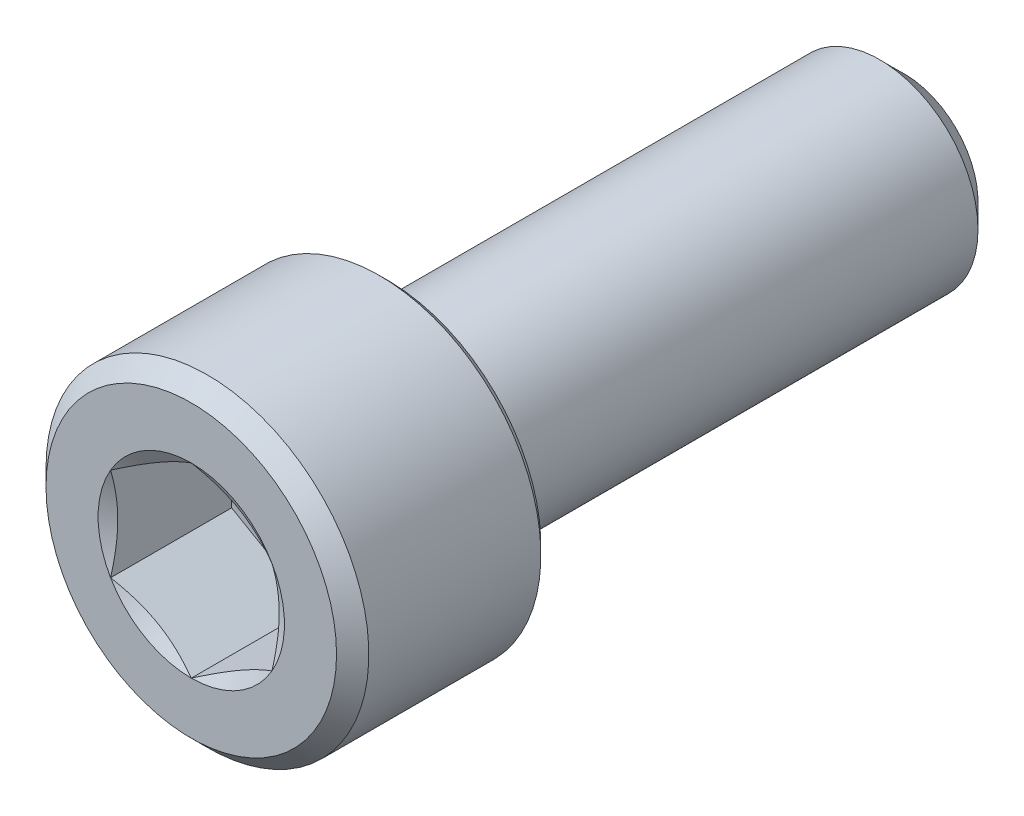
ISO-10303-21;
HEADER;
FILE_DESCRIPTION(('STEP AP214'),'2;1');
FILE_NAME('part.step','',(''),(''),'','','');
FILE_SCHEMA(('AUTOMOTIVE_DESIGN { 1 0 10303 214 1 1 1 1 }'));
ENDSEC;
DATA;
#1=APPLICATION_CONTEXT('core data for automotive mechanical design processes');
#2=APPLICATION_PROTOCOL_DEFINITION('international standard','automotive_design',2000,#1);
#3=PRODUCT_CONTEXT('',#1,'mechanical');
#4=PRODUCT('Part','Part','',(#3));
#5=PRODUCT_RELATED_PRODUCT_CATEGORY('part','',(#4));
#6=PRODUCT_DEFINITION_FORMATION('','',#4);
#7=PRODUCT_DEFINITION_CONTEXT('part definition',#1,'design');
#8=PRODUCT_DEFINITION('design','',#6,#7);
#9=PRODUCT_DEFINITION_SHAPE('','',#8);
#10=(LENGTH_UNIT() NAMED_UNIT(*) SI_UNIT(.MILLI.,.METRE.));
#11=(NAMED_UNIT(*) PLANE_ANGLE_UNIT() SI_UNIT($,.RADIAN.));
#12=(NAMED_UNIT(*) SI_UNIT($,.STERADIAN.) SOLID_ANGLE_UNIT());
#13=UNCERTAINTY_MEASURE_WITH_UNIT(LENGTH_MEASURE(1.E-05),#10,'distance_accuracy_value','');
#14=(GEOMETRIC_REPRESENTATION_CONTEXT(3) GLOBAL_UNCERTAINTY_ASSIGNED_CONTEXT((#13)) GLOBAL_UNIT_ASSIGNED_CONTEXT((#10,
#11,#12)) REPRESENTATION_CONTEXT('',''));
#15=CARTESIAN_POINT('',(0.,0.,0.));
#16=DIRECTION('',(0.,0.,1.));
#17=DIRECTION('',(1.,0.,0.));
#18=AXIS2_PLACEMENT_3D('',#15,#16,#17);
#19=CARTESIAN_POINT('',(0.,3.96875,8.763));
#20=DIRECTION('',(0.,0.,1.));
#21=DIRECTION('',(1.,0.,0.));
#22=AXIS2_PLACEMENT_3D('',#19,#20,#21);
#23=PLANE('',#22);
#24=CARTESIAN_POINT('',(0.,0.,8.763));
#25=DIRECTION('',(0.,0.,1.));
#26=DIRECTION('',(1.,0.,0.));
#27=AXIS2_PLACEMENT_3D('',#24,#25,#26);
#28=CIRCLE('',#27,3.571875);
#29=CARTESIAN_POINT('',(-3.571875,0.,8.763));
#30=VERTEX_POINT('',#29);
#31=EDGE_CURVE('E169',#30,#30,#28,.T.);
#32=ORIENTED_EDGE('',*,*,#31,.T.);
#33=EDGE_LOOP('',(#32));
#34=FACE_BOUND('',#33,.T.);
#35=CARTESIAN_POINT('',(0.,0.,8.763));
#36=DIRECTION('',(0.,0.,1.));
#37=DIRECTION('',(1.,0.,0.));
#38=AXIS2_PLACEMENT_3D('',#35,#36,#37);
#39=CIRCLE('',#38,2.29135888084633);
#40=CARTESIAN_POINT('',(1.984375,1.14567944042316,8.763));
#41=VERTEX_POINT('',#40);
#42=CARTESIAN_POINT('',(0.,2.29135888084632,8.763));
#43=VERTEX_POINT('',#42);
#44=EDGE_CURVE('E87',#41,#43,#39,.T.);
#45=ORIENTED_EDGE('',*,*,#44,.F.);
#46=CARTESIAN_POINT('',(1.984375,-1.14567944042316,8.763));
#47=VERTEX_POINT('',#46);
#48=EDGE_CURVE('E47',#47,#41,#39,.T.);
#49=ORIENTED_EDGE('',*,*,#48,.F.);
#50=CARTESIAN_POINT('',(0.,-2.29135888084633,8.763));
#51=VERTEX_POINT('',#50);
#52=EDGE_CURVE('E274',#51,#47,#39,.T.);
#53=ORIENTED_EDGE('',*,*,#52,.F.);
#54=CARTESIAN_POINT('',(-1.984375,-1.14567944042317,8.763));
#55=VERTEX_POINT('',#54);
#56=EDGE_CURVE('E54',#55,#51,#39,.T.);
#57=ORIENTED_EDGE('',*,*,#56,.F.);
#58=CARTESIAN_POINT('',(-1.984375,1.14567944042316,8.763));
#59=VERTEX_POINT('',#58);
#60=EDGE_CURVE('E127',#59,#55,#39,.T.);
#61=ORIENTED_EDGE('',*,*,#60,.F.);
#62=EDGE_CURVE('E96',#43,#59,#39,.T.);
#63=ORIENTED_EDGE('',*,*,#62,.F.);
#64=EDGE_LOOP('',(#45,#49,#53,#57,#61,#63));
#65=FACE_BOUND('',#64,.T.);
#66=ADVANCED_FACE('F33',(#34,#65),#23,.T.);
#67=CARTESIAN_POINT('',(0.,0.,-8.763));
#68=DIRECTION('',(0.,0.,-1.));
#69=DIRECTION('',(-1.,0.,0.));
#70=AXIS2_PLACEMENT_3D('',#67,#68,#69);
#71=CYLINDRICAL_SURFACE('',#70,3.96875);
#72=CARTESIAN_POINT('',(0.,0.,4.13543749999999));
#73=DIRECTION('',(0.,0.,-1.));
#74=DIRECTION('',(-1.,0.,0.));
#75=AXIS2_PLACEMENT_3D('',#72,#73,#74);
#76=CIRCLE('',#75,3.96875);
#77=CARTESIAN_POINT('',(-3.96875,0.,4.13543749999999));
#78=VERTEX_POINT('',#77);
#79=EDGE_CURVE('E11',#78,#78,#76,.F.);
#80=ORIENTED_EDGE('',*,*,#79,.T.);
#81=EDGE_LOOP('',(#80));
#82=FACE_BOUND('',#81,.T.);
#83=CARTESIAN_POINT('',(0.,0.,8.366125));
#84=DIRECTION('',(0.,0.,1.));
#85=DIRECTION('',(1.,0.,0.));
#86=AXIS2_PLACEMENT_3D('',#83,#84,#85);
#87=CIRCLE('',#86,3.96875);
#88=CARTESIAN_POINT('',(-3.96875,0.,8.366125));
#89=VERTEX_POINT('',#88);
#90=EDGE_CURVE('E106',#89,#89,#87,.F.);
#91=ORIENTED_EDGE('',*,*,#90,.T.);
#92=EDGE_LOOP('',(#91));
#93=FACE_BOUND('',#92,.T.);
#94=ADVANCED_FACE('F186',(#82,#93),#71,.T.);
#95=CARTESIAN_POINT('',(0.,3.96875,3.937));
#96=DIRECTION('',(0.,0.,-1.));
#97=DIRECTION('',(-1.,0.,0.));
#98=AXIS2_PLACEMENT_3D('',#95,#96,#97);
#99=PLANE('',#98);
#100=CARTESIAN_POINT('',(0.,0.,3.937));
#101=DIRECTION('',(0.,0.,-1.));
#102=DIRECTION('',(-1.,0.,0.));
#103=AXIS2_PLACEMENT_3D('',#100,#101,#102);
#104=CIRCLE('',#103,3.77031250000001);
#105=CARTESIAN_POINT('',(-3.77031250000001,0.,3.937));
#106=VERTEX_POINT('',#105);
#107=EDGE_CURVE('E41',#106,#106,#104,.T.);
#108=ORIENTED_EDGE('',*,*,#107,.T.);
#109=EDGE_LOOP('',(#108));
#110=FACE_BOUND('',#109,.T.);
#111=CARTESIAN_POINT('',(0.,0.,3.937));
#112=DIRECTION('',(0.,0.,-1.));
#113=DIRECTION('',(-1.,0.,0.));
#114=AXIS2_PLACEMENT_3D('',#111,#112,#113);
#115=CIRCLE('',#114,2.413);
#116=CARTESIAN_POINT('',(-2.413,0.,3.937));
#117=VERTEX_POINT('',#116);
#118=EDGE_CURVE('E107',#117,#117,#115,.T.);
#119=ORIENTED_EDGE('',*,*,#118,.F.);
#120=EDGE_LOOP('',(#119));
#121=FACE_BOUND('',#120,.T.);
#122=ADVANCED_FACE('F174',(#110,#121),#99,.T.);
#123=CARTESIAN_POINT('',(0.,0.,-8.763));
#124=DIRECTION('',(0.,0.,-1.));
#125=DIRECTION('',(-1.,0.,0.));
#126=AXIS2_PLACEMENT_3D('',#123,#124,#125);
#127=CYLINDRICAL_SURFACE('',#126,2.413);
#128=ORIENTED_EDGE('',*,*,#118,.T.);
#129=EDGE_LOOP('',(#128));
#130=FACE_BOUND('',#129,.T.);
#131=CARTESIAN_POINT('',(0.,0.,-8.16768749999999));
#132=DIRECTION('',(0.,0.,-1.));
#133=DIRECTION('',(-1.,0.,0.));
#134=AXIS2_PLACEMENT_3D('',#131,#132,#133);
#135=CIRCLE('',#134,2.413);
#136=CARTESIAN_POINT('',(-2.413,0.,-8.16768749999999));
#137=VERTEX_POINT('',#136);
#138=EDGE_CURVE('E215',#137,#137,#135,.T.);
#139=ORIENTED_EDGE('',*,*,#138,.F.);
#140=EDGE_LOOP('',(#139));
#141=FACE_BOUND('',#140,.T.);
#142=ADVANCED_FACE('F197',(#130,#141),#127,.T.);
#143=CARTESIAN_POINT('',(0.,0.,-8.763));
#144=DIRECTION('',(0.,0.,1.));
#145=DIRECTION('',(1.,0.,0.));
#146=AXIS2_PLACEMENT_3D('',#143,#144,#145);
#147=CONICAL_SURFACE('',#146,1.8176875,0.785398163397443);
#148=ORIENTED_EDGE('',*,*,#138,.T.);
#149=EDGE_LOOP('',(#148));
#150=FACE_BOUND('',#149,.T.);
#151=CARTESIAN_POINT('',(0.,0.,-8.763));
#152=DIRECTION('',(0.,0.,-1.));
#153=DIRECTION('',(-1.,0.,0.));
#154=AXIS2_PLACEMENT_3D('',#151,#152,#153);
#155=CIRCLE('',#154,1.8176875);
#156=CARTESIAN_POINT('',(-1.8176875,0.,-8.763));
#157=VERTEX_POINT('',#156);
#158=EDGE_CURVE('E213',#157,#157,#155,.T.);
#159=ORIENTED_EDGE('',*,*,#158,.F.);
#160=EDGE_LOOP('',(#159));
#161=FACE_BOUND('',#160,.T.);
#162=ADVANCED_FACE('F200',(#150,#161),#147,.T.);
#163=CARTESIAN_POINT('',(0.,1.8176875,-8.763));
#164=DIRECTION('',(0.,0.,-1.));
#165=DIRECTION('',(-1.,0.,0.));
#166=AXIS2_PLACEMENT_3D('',#163,#164,#165);
#167=PLANE('',#166);
#168=ORIENTED_EDGE('',*,*,#158,.T.);
#169=EDGE_LOOP('',(#168));
#170=FACE_BOUND('',#169,.T.);
#171=ADVANCED_FACE('F203',(#170),#167,.T.);
#172=CARTESIAN_POINT('',(0.,0.,8.763));
#173=DIRECTION('',(0.,0.,1.));
#174=DIRECTION('',(1.,0.,0.));
#175=AXIS2_PLACEMENT_3D('',#172,#173,#174);
#176=CONICAL_SURFACE('',#175,2.29135888084633,1.0471975511966);
#177=ORIENTED_EDGE('',*,*,#62,.T.);
#178=CARTESIAN_POINT('',(0.000199999999999337,2.29147435090016,8.76306667170578));
#179=CARTESIAN_POINT('',(-0.0870046387806771,2.24112672922556,8.73398568224019));
#180=CARTESIAN_POINT('',(-0.174962019304997,2.19034451190263,8.70753720802705));
#181=CARTESIAN_POINT('',(-0.352399978672321,2.08790065829744,8.66137027120647));
#182=CARTESIAN_POINT('',(-0.44188371125632,2.03623720120198,8.64166814224896));
#183=CARTESIAN_POINT('',(-0.61974214801247,1.93355058486317,8.61099773193153));
#184=CARTESIAN_POINT('',(-0.708089480306095,1.88254322878126,8.59982534272021));
#185=CARTESIAN_POINT('',(-0.885200028110951,1.78028840632981,8.58648579605443));
#186=CARTESIAN_POINT('',(-0.973962599510548,1.72904131183828,8.58430759446012));
#187=CARTESIAN_POINT('',(-1.13983230286466,1.63327639395638,8.58882955150835));
#188=CARTESIAN_POINT('',(-1.21696421566591,1.58874426333747,8.59441941345587));
#189=CARTESIAN_POINT('',(-1.37072550718908,1.49997014028562,8.61213893389701));
#190=CARTESIAN_POINT('',(-1.44735435374553,1.45572845509857,8.62427465032953));
#191=CARTESIAN_POINT('',(-1.60143288850678,1.36677117157782,8.65461415884436));
#192=CARTESIAN_POINT('',(-1.67886306721268,1.32206683705856,8.67294660929099));
#193=CARTESIAN_POINT('',(-1.83256831124359,1.23332507304146,8.71455450640018));
#194=CARTESIAN_POINT('',(-1.90884534705293,1.18928650588395,8.73782017128238));
#195=CARTESIAN_POINT('',(-1.984575,1.14556397036932,8.76306667170578));
#196=B_SPLINE_CURVE_WITH_KNOTS('',3,(#178,#179,#180,#181,#182,#183,#184,#185,#186,#187,#188,
#189,#190,#191,#192,#193,#194,#195),.UNSPECIFIED.,.F.,.F.,(4,2,2,2,2,2,2,2,4),(0.,
0.314555137114086,0.629866549668807,0.937373439505935,1.24450262309398,1.51196650590478,
1.77967834211415,2.05332989762155,2.32644383656793),.UNSPECIFIED.);
#197=EDGE_CURVE('E101',#43,#59,#196,.T.);
#198=ORIENTED_EDGE('',*,*,#197,.F.);
#199=EDGE_LOOP('',(#177,#198));
#200=FACE_BOUND('',#199,.T.);
#201=ADVANCED_FACE('F102',(#200),#176,.F.);
#202=ORIENTED_EDGE('',*,*,#60,.T.);
#203=CARTESIAN_POINT('',(-1.984375,-2.96692860034506,9.50086065109237));
#204=CARTESIAN_POINT('',(-1.984375,-2.88123645369666,9.45974880177529));
#205=CARTESIAN_POINT('',(-1.984375,-2.79533554929687,9.41906397295605));
#206=CARTESIAN_POINT('',(-1.984375,-2.62300496253372,9.33879059794519));
#207=CARTESIAN_POINT('',(-1.984375,-2.53657518838115,9.29920224904708));
#208=CARTESIAN_POINT('',(-1.984375,-2.36258003650985,9.22114291442959));
#209=CARTESIAN_POINT('',(-1.984375,-2.27501095051754,9.18268016339894));
#210=CARTESIAN_POINT('',(-1.984375,-2.09913795632987,9.10747942709752));
#211=CARTESIAN_POINT('',(-1.984375,-2.01083408662377,9.07074135214644));
#212=CARTESIAN_POINT('',(-1.984375,-1.83102497893539,8.99851372935496));
#213=CARTESIAN_POINT('',(-1.984375,-1.73949640320228,8.96308193907389));
#214=CARTESIAN_POINT('',(-1.984375,-1.55533214713673,8.89516418355678));
#215=CARTESIAN_POINT('',(-1.984375,-1.46269633980312,8.86267855999264));
#216=CARTESIAN_POINT('',(-1.984375,-1.27638419434466,8.80158213635921));
#217=CARTESIAN_POINT('',(-1.984375,-1.18271082678456,8.7729623752382));
#218=CARTESIAN_POINT('',(-1.984375,-0.994021652382587,8.72057636886058));
#219=CARTESIAN_POINT('',(-1.984375,-0.899006185229732,8.69680891819845));
#220=CARTESIAN_POINT('',(-1.984375,-0.707830512458421,8.65539473938057));
#221=CARTESIAN_POINT('',(-1.984375,-0.611673084373239,8.63773544006603));
#222=CARTESIAN_POINT('',(-1.984375,-0.418283092113672,8.60969309653349));
#223=CARTESIAN_POINT('',(-1.984375,-0.321050601045251,8.59930956060593));
#224=CARTESIAN_POINT('',(-1.984375,-0.127210752774484,8.5867852009906));
#225=CARTESIAN_POINT('',(-1.984375,-0.0306098639781242,8.58454710736856));
#226=CARTESIAN_POINT('',(-1.984375,0.162431915887105,8.58824204703217));
#227=CARTESIAN_POINT('',(-1.984375,0.258872796678697,8.59417558627506));
#228=CARTESIAN_POINT('',(-1.984375,0.496826477184733,8.61837557369152));
#229=CARTESIAN_POINT('',(-1.984375,0.637878211825127,8.64117722021417));
#230=CARTESIAN_POINT('',(-1.984375,0.917238703702528,8.69997602426137));
#231=CARTESIAN_POINT('',(-1.984375,1.05554394232965,8.73598908554252));
#232=CARTESIAN_POINT('',(-1.984375,1.26239464896717,8.79750820789035));
#233=CARTESIAN_POINT('',(-1.984375,1.33200934564274,8.81955142641455));
#234=CARTESIAN_POINT('',(-1.984375,1.47051409380588,8.8656769862575));
#235=CARTESIAN_POINT('',(-1.984375,1.53940456776433,8.88975805500612));
#236=CARTESIAN_POINT('',(-1.984375,1.67655293465251,8.93960958868946));
#237=CARTESIAN_POINT('',(-1.984375,1.74481093998431,8.96537974660228));
#238=CARTESIAN_POINT('',(-1.984375,1.88078910071683,9.01833071268156));
#239=CARTESIAN_POINT('',(-1.984375,1.94850916300286,9.04551175918296));
#240=CARTESIAN_POINT('',(-1.984375,2.12136731788458,9.11663362383593));
#241=CARTESIAN_POINT('',(-1.984375,2.22615977384556,9.16141359670133));
#242=CARTESIAN_POINT('',(-1.984375,2.43479837304526,9.25313219568247));
#243=CARTESIAN_POINT('',(-1.984375,2.5386444446916,9.30007098351126));
#244=CARTESIAN_POINT('',(-1.984375,2.84907841644385,9.44336456132352));
#245=CARTESIAN_POINT('',(-1.984375,3.05452739791262,9.54218187526435));
#246=CARTESIAN_POINT('',(-1.984375,3.46367014223902,9.74396088572476));
#247=CARTESIAN_POINT('',(-1.984375,3.66736143684957,9.84692752775299));
#248=CARTESIAN_POINT('',(-1.984375,4.0733484486621,10.0555084165548));
#249=CARTESIAN_POINT('',(-1.984375,4.27564433912762,10.1611223267935));
#250=CARTESIAN_POINT('',(-1.984375,4.66022184962415,10.3641193368616));
#251=CARTESIAN_POINT('',(-1.984375,4.84259034249047,10.4613384272925));
#252=CARTESIAN_POINT('',(-1.984375,5.20674070245669,10.6568843204883));
#253=CARTESIAN_POINT('',(-1.984375,5.38852254752481,10.7552111642466));
#254=CARTESIAN_POINT('',(-1.984375,5.7511724793118,10.952443617507));
#255=CARTESIAN_POINT('',(-1.984375,5.93204171415672,11.0513471187779));
#256=CARTESIAN_POINT('',(-1.984375,6.29341450955435,11.2497978398903));
#257=CARTESIAN_POINT('',(-1.984375,6.47391808874827,11.3493450257738));
#258=CARTESIAN_POINT('',(-1.984375,6.6542902961452,11.4491282522634));
#259=B_SPLINE_CURVE_WITH_KNOTS('',3,(#203,#204,#205,#206,#207,#208,#209,#210,#211,#212,#213,
#214,#215,#216,#217,#218,#219,#220,#221,#222,#223,#224,#225,#226,#227,#228,#229,#230,#231,#232,
#233,#234,#235,#236,#237,#238,#239,#240,#241,#242,#243,#244,#245,#246,#247,#248,#249,#250,#251,
#252,#253,#254,#255,#256,#257,#258),.UNSPECIFIED.,.F.,.F.,(4,2,2,2,2,2,2,2,2,2,2,2,2,2,2,2,2,2,
2,2,2,2,2,2,2,2,2,4),(0.,0.285135519832372,0.570322016122786,0.85723846381979,1.14413997577448,
1.43854271801315,1.7329795590899,2.02672173491208,2.32039085060263,2.61345191984503,
2.90649318156652,3.19602335108127,3.48557144803805,3.91334047285798,4.34162614021154,
4.56066589824458,4.7795698685272,4.99843415889189,5.21733554208811,5.55917796423186,
5.9010460350302,6.58489509249956,7.26958483186156,7.95418796687477,8.57417425374277,
9.19418355960939,9.81261585701216,10.431015790458),.UNSPECIFIED.);
#260=EDGE_CURVE('E95',#59,#55,#259,.F.);
#261=ORIENTED_EDGE('',*,*,#260,.F.);
#262=EDGE_LOOP('',(#202,#261));
#263=FACE_BOUND('',#262,.T.);
#264=ADVANCED_FACE('F210',(#263),#176,.F.);
#265=ORIENTED_EDGE('',*,*,#56,.T.);
#266=CARTESIAN_POINT('',(-1.984575,-1.14556397036933,8.76306667170578));
#267=CARTESIAN_POINT('',(-1.89737036121932,-1.19591159204393,8.73398568224018));
#268=CARTESIAN_POINT('',(-1.809412980695,-1.24669380936686,8.70753720802705));
#269=CARTESIAN_POINT('',(-1.63197502132768,-1.34913766297205,8.66137027120647));
#270=CARTESIAN_POINT('',(-1.54249128874368,-1.40080112006751,8.64166814224896));
#271=CARTESIAN_POINT('',(-1.36463285198753,-1.50348773640632,8.61099773193153));
#272=CARTESIAN_POINT('',(-1.27628551969391,-1.55449509248823,8.59982534272021));
#273=CARTESIAN_POINT('',(-1.09917497188905,-1.65674991493968,8.58648579605442));
#274=CARTESIAN_POINT('',(-1.01041240048945,-1.7079970094312,8.58430759446012));
#275=CARTESIAN_POINT('',(-0.844542697135339,-1.80376192731311,8.58882955150835));
#276=CARTESIAN_POINT('',(-0.767410784334094,-1.84829405793202,8.59441941345587));
#277=CARTESIAN_POINT('',(-0.613649492810919,-1.93706818098387,8.61213893389701));
#278=CARTESIAN_POINT('',(-0.537020646254476,-1.98130986617092,8.62427465032952));
#279=CARTESIAN_POINT('',(-0.382942111493217,-2.07026714969167,8.65461415884436));
#280=CARTESIAN_POINT('',(-0.305511932787317,-2.11497148421093,8.67294660929099));
#281=CARTESIAN_POINT('',(-0.151806688756411,-2.20371324822803,8.71455450640018));
#282=CARTESIAN_POINT('',(-0.0755296529470673,-2.24775181538554,8.73782017128238));
#283=CARTESIAN_POINT('',(0.000200000000000565,-2.29147435090016,8.76306667170578));
#284=B_SPLINE_CURVE_WITH_KNOTS('',3,(#266,#267,#268,#269,#270,#271,#272,#273,#274,#275,#276,
#277,#278,#279,#280,#281,#282,#283),.UNSPECIFIED.,.F.,.F.,(4,2,2,2,2,2,2,2,4),(0.,
0.314555137114085,0.629866549668806,0.937373439505932,1.24450262309398,1.51196650590478,
1.77967834211415,2.05332989762155,2.32644383656793),.UNSPECIFIED.);
#285=EDGE_CURVE('E137',#55,#51,#284,.T.);
#286=ORIENTED_EDGE('',*,*,#285,.F.);
#287=EDGE_LOOP('',(#265,#286));
#288=FACE_BOUND('',#287,.T.);
#289=ADVANCED_FACE('F277',(#288),#176,.F.);
#290=ORIENTED_EDGE('',*,*,#52,.T.);
#291=CARTESIAN_POINT('',(-0.000199999999999211,-2.29147435090017,8.76306667170578));
#292=CARTESIAN_POINT('',(0.087004638780677,-2.24112672922556,8.73398568224018));
#293=CARTESIAN_POINT('',(0.174962019304997,-2.19034451190263,8.70753720802705));
#294=CARTESIAN_POINT('',(0.35239997867232,-2.08790065829744,8.66137027120647));
#295=CARTESIAN_POINT('',(0.441883711256319,-2.03623720120198,8.64166814224896));
#296=CARTESIAN_POINT('',(0.619742148012468,-1.93355058486317,8.61099773193153));
#297=CARTESIAN_POINT('',(0.708089480306093,-1.88254322878126,8.59982534272021));
#298=CARTESIAN_POINT('',(0.885200028110949,-1.78028840632981,8.58648579605442));
#299=CARTESIAN_POINT('',(0.973962599510545,-1.72904131183829,8.58430759446012));
#300=CARTESIAN_POINT('',(1.13983230286466,-1.63327639395638,8.58882955150835));
#301=CARTESIAN_POINT('',(1.21696421566591,-1.58874426333747,8.59441941345587));
#302=CARTESIAN_POINT('',(1.37072550718908,-1.49997014028563,8.61213893389701));
#303=CARTESIAN_POINT('',(1.44735435374552,-1.45572845509857,8.62427465032952));
#304=CARTESIAN_POINT('',(1.60143288850678,-1.36677117157782,8.65461415884436));
#305=CARTESIAN_POINT('',(1.67886306721268,-1.32206683705856,8.67294660929099));
#306=CARTESIAN_POINT('',(1.83256831124359,-1.23332507304146,8.71455450640018));
#307=CARTESIAN_POINT('',(1.90884534705293,-1.18928650588395,8.73782017128238));
#308=CARTESIAN_POINT('',(1.984575,-1.14556397036933,8.76306667170578));
#309=B_SPLINE_CURVE_WITH_KNOTS('',3,(#291,#292,#293,#294,#295,#296,#297,#298,#299,#300,#301,
#302,#303,#304,#305,#306,#307,#308),.UNSPECIFIED.,.F.,.F.,(4,2,2,2,2,2,2,2,4),(0.,
0.314555137114085,0.629866549668805,0.937373439505931,1.24450262309398,1.51196650590478,
1.77967834211415,2.05332989762155,2.32644383656793),.UNSPECIFIED.);
#310=EDGE_CURVE('E251',#51,#47,#309,.T.);
#311=ORIENTED_EDGE('',*,*,#310,.F.);
#312=EDGE_LOOP('',(#290,#311));
#313=FACE_BOUND('',#312,.T.);
#314=ADVANCED_FACE('F276',(#313),#176,.F.);
#315=ORIENTED_EDGE('',*,*,#48,.T.);
#316=CARTESIAN_POINT('',(1.984375,-2.96692860034506,9.50086065109237));
#317=CARTESIAN_POINT('',(1.984375,-2.88123645369666,9.45974880177529));
#318=CARTESIAN_POINT('',(1.984375,-2.79533554929687,9.41906397295605));
#319=CARTESIAN_POINT('',(1.984375,-2.62300496253372,9.33879059794519));
#320=CARTESIAN_POINT('',(1.984375,-2.53657518838114,9.29920224904708));
#321=CARTESIAN_POINT('',(1.984375,-2.36258003650985,9.22114291442959));
#322=CARTESIAN_POINT('',(1.984375,-2.27501095051754,9.18268016339894));
#323=CARTESIAN_POINT('',(1.984375,-2.09913795632987,9.10747942709752));
#324=CARTESIAN_POINT('',(1.984375,-2.01083408662377,9.07074135214644));
#325=CARTESIAN_POINT('',(1.984375,-1.83102497893539,8.99851372935496));
#326=CARTESIAN_POINT('',(1.984375,-1.73949640320228,8.96308193907389));
#327=CARTESIAN_POINT('',(1.984375,-1.55533214713673,8.89516418355678));
#328=CARTESIAN_POINT('',(1.984375,-1.46269633980312,8.86267855999264));
#329=CARTESIAN_POINT('',(1.984375,-1.27638419434466,8.80158213635921));
#330=CARTESIAN_POINT('',(1.984375,-1.18271082678456,8.7729623752382));
#331=CARTESIAN_POINT('',(1.984375,-0.994021652382587,8.72057636886058));
#332=CARTESIAN_POINT('',(1.984375,-0.899006185229732,8.69680891819845));
#333=CARTESIAN_POINT('',(1.984375,-0.70783051245842,8.65539473938057));
#334=CARTESIAN_POINT('',(1.984375,-0.611673084373239,8.63773544006603));
#335=CARTESIAN_POINT('',(1.984375,-0.418283092113671,8.60969309653349));
#336=CARTESIAN_POINT('',(1.984375,-0.32105060104525,8.59930956060593));
#337=CARTESIAN_POINT('',(1.984375,-0.127210752774483,8.5867852009906));
#338=CARTESIAN_POINT('',(1.984375,-0.0306098639781234,8.58454710736856));
#339=CARTESIAN_POINT('',(1.984375,0.162431915887106,8.58824204703217));
#340=CARTESIAN_POINT('',(1.984375,0.258872796678698,8.59417558627506));
#341=CARTESIAN_POINT('',(1.984375,0.496826477184734,8.61837557369152));
#342=CARTESIAN_POINT('',(1.984375,0.637878211825128,8.64117722021417));
#343=CARTESIAN_POINT('',(1.984375,0.917238703702529,8.69997602426137));
#344=CARTESIAN_POINT('',(1.984375,1.05554394232965,8.73598908554252));
#345=CARTESIAN_POINT('',(1.984375,1.26239464896717,8.79750820789035));
#346=CARTESIAN_POINT('',(1.984375,1.33200934564274,8.81955142641455));
#347=CARTESIAN_POINT('',(1.984375,1.47051409380588,8.8656769862575));
#348=CARTESIAN_POINT('',(1.984375,1.53940456776433,8.88975805500613));
#349=CARTESIAN_POINT('',(1.984375,1.67655293465251,8.93960958868946));
#350=CARTESIAN_POINT('',(1.984375,1.74481093998432,8.96537974660229));
#351=CARTESIAN_POINT('',(1.984375,1.88078910071683,9.01833071268157));
#352=CARTESIAN_POINT('',(1.984375,1.94850916300287,9.04551175918296));
#353=CARTESIAN_POINT('',(1.984375,2.12136731788459,9.11663362383593));
#354=CARTESIAN_POINT('',(1.984375,2.22615977384557,9.16141359670133));
#355=CARTESIAN_POINT('',(1.984375,2.43479837304527,9.25313219568247));
#356=CARTESIAN_POINT('',(1.984375,2.5386444446916,9.30007098351126));
#357=CARTESIAN_POINT('',(1.984375,2.84907841644385,9.44336456132352));
#358=CARTESIAN_POINT('',(1.984375,3.05452739791262,9.54218187526435));
#359=CARTESIAN_POINT('',(1.984375,3.46367014223902,9.74396088572476));
#360=CARTESIAN_POINT('',(1.984375,3.66736143684958,9.84692752775299));
#361=CARTESIAN_POINT('',(1.984375,4.07334844866211,10.0555084165548));
#362=CARTESIAN_POINT('',(1.984375,4.27564433912762,10.1611223267935));
#363=CARTESIAN_POINT('',(1.984375,4.66022184962415,10.3641193368616));
#364=CARTESIAN_POINT('',(1.984375,4.84259034249047,10.4613384272925));
#365=CARTESIAN_POINT('',(1.984375,5.20674070245669,10.6568843204883));
#366=CARTESIAN_POINT('',(1.984375,5.38852254752481,10.7552111642466));
#367=CARTESIAN_POINT('',(1.984375,5.75117247931181,10.952443617507));
#368=CARTESIAN_POINT('',(1.984375,5.93204171415673,11.0513471187779));
#369=CARTESIAN_POINT('',(1.984375,6.29341450955435,11.2497978398903));
#370=CARTESIAN_POINT('',(1.984375,6.47391808874828,11.3493450257738));
#371=CARTESIAN_POINT('',(1.984375,6.6542902961452,11.4491282522634));
#372=B_SPLINE_CURVE_WITH_KNOTS('',3,(#316,#317,#318,#319,#320,#321,#322,#323,#324,#325,#326,
#327,#328,#329,#330,#331,#332,#333,#334,#335,#336,#337,#338,#339,#340,#341,#342,#343,#344,#345,
#346,#347,#348,#349,#350,#351,#352,#353,#354,#355,#356,#357,#358,#359,#360,#361,#362,#363,#364,
#365,#366,#367,#368,#369,#370,#371),.UNSPECIFIED.,.F.,.F.,(4,2,2,2,2,2,2,2,2,2,2,2,2,2,2,2,2,2,
2,2,2,2,2,2,2,2,2,4),(0.,0.285135519832372,0.570322016122785,0.85723846381979,1.14413997577448,
1.43854271801315,1.7329795590899,2.02672173491208,2.32039085060262,2.61345191984503,
2.90649318156652,3.19602335108127,3.48557144803805,3.91334047285798,4.34162614021154,
4.56066589824458,4.7795698685272,4.99843415889189,5.21733554208811,5.55917796423187,
5.90104603503021,6.58489509249956,7.26958483186156,7.95418796687477,8.57417425374277,
9.19418355960939,9.81261585701216,10.431015790458),.UNSPECIFIED.);
#373=EDGE_CURVE('E117',#47,#41,#372,.T.);
#374=ORIENTED_EDGE('',*,*,#373,.F.);
#375=EDGE_LOOP('',(#315,#374));
#376=FACE_BOUND('',#375,.T.);
#377=ADVANCED_FACE('F287',(#376),#176,.F.);
#378=ORIENTED_EDGE('',*,*,#44,.T.);
#379=CARTESIAN_POINT('',(1.984575,1.14556397036933,8.76306667170578));
#380=CARTESIAN_POINT('',(1.89737036121932,1.19591159204393,8.73398568224019));
#381=CARTESIAN_POINT('',(1.809412980695,1.24669380936686,8.70753720802705));
#382=CARTESIAN_POINT('',(1.63197502132768,1.34913766297205,8.66137027120647));
#383=CARTESIAN_POINT('',(1.54249128874368,1.40080112006751,8.64166814224896));
#384=CARTESIAN_POINT('',(1.36463285198753,1.50348773640632,8.61099773193153));
#385=CARTESIAN_POINT('',(1.27628551969391,1.55449509248823,8.59982534272021));
#386=CARTESIAN_POINT('',(1.09917497188905,1.65674991493968,8.58648579605443));
#387=CARTESIAN_POINT('',(1.01041240048945,1.7079970094312,8.58430759446012));
#388=CARTESIAN_POINT('',(0.844542697135339,1.80376192731311,8.58882955150835));
#389=CARTESIAN_POINT('',(0.767410784334094,1.84829405793202,8.59441941345587));
#390=CARTESIAN_POINT('',(0.613649492810919,1.93706818098387,8.61213893389701));
#391=CARTESIAN_POINT('',(0.537020646254476,1.98130986617092,8.62427465032952));
#392=CARTESIAN_POINT('',(0.382942111493217,2.07026714969167,8.65461415884437));
#393=CARTESIAN_POINT('',(0.305511932787317,2.11497148421093,8.67294660929099));
#394=CARTESIAN_POINT('',(0.151806688756411,2.20371324822803,8.71455450640018));
#395=CARTESIAN_POINT('',(0.0755296529470673,2.24775181538554,8.73782017128238));
#396=CARTESIAN_POINT('',(-0.000200000000000733,2.29147435090016,8.76306667170578));
#397=B_SPLINE_CURVE_WITH_KNOTS('',3,(#379,#380,#381,#382,#383,#384,#385,#386,#387,#388,#389,
#390,#391,#392,#393,#394,#395,#396),.UNSPECIFIED.,.F.,.F.,(4,2,2,2,2,2,2,2,4),(0.,
0.314555137114086,0.629866549668806,0.937373439505932,1.24450262309398,1.51196650590478,
1.77967834211415,2.05332989762155,2.32644383656793),.UNSPECIFIED.);
#398=EDGE_CURVE('E91',#41,#43,#397,.T.);
#399=ORIENTED_EDGE('',*,*,#398,.F.);
#400=EDGE_LOOP('',(#378,#399));
#401=FACE_BOUND('',#400,.T.);
#402=ADVANCED_FACE('F89',(#401),#176,.F.);
#403=CARTESIAN_POINT('',(0.,0.,5.7864375));
#404=DIRECTION('',(0.,0.,1.));
#405=DIRECTION('',(1.,0.,0.));
#406=AXIS2_PLACEMENT_3D('',#403,#404,#405);
#407=PLANE('',#406);
#408=DIRECTION('',(-0.866025403784439,0.5,0.));
#409=VECTOR('',#408,1.);
#410=CARTESIAN_POINT('',(1.984375,1.14567944042316,5.7864375));
#411=LINE('',#410,#409);
#412=CARTESIAN_POINT('',(1.984375,1.14567944042316,5.7864375));
#413=VERTEX_POINT('',#412);
#414=CARTESIAN_POINT('',(0.,2.29135888084633,5.7864375));
#415=VERTEX_POINT('',#414);
#416=EDGE_CURVE('E116',#413,#415,#411,.T.);
#417=ORIENTED_EDGE('',*,*,#416,.T.);
#418=DIRECTION('',(-0.866025403784438,-0.5,0.));
#419=VECTOR('',#418,1.);
#420=CARTESIAN_POINT('',(0.,2.29135888084633,5.7864375));
#421=LINE('',#420,#419);
#422=CARTESIAN_POINT('',(-1.984375,1.14567944042316,5.7864375));
#423=VERTEX_POINT('',#422);
#424=EDGE_CURVE('E121',#415,#423,#421,.T.);
#425=ORIENTED_EDGE('',*,*,#424,.T.);
#426=DIRECTION('',(0.,-1.,0.));
#427=VECTOR('',#426,1.);
#428=CARTESIAN_POINT('',(-1.984375,1.14567944042316,5.7864375));
#429=LINE('',#428,#427);
#430=CARTESIAN_POINT('',(-1.984375,-1.14567944042316,5.7864375));
#431=VERTEX_POINT('',#430);
#432=EDGE_CURVE('E237',#423,#431,#429,.T.);
#433=ORIENTED_EDGE('',*,*,#432,.T.);
#434=DIRECTION('',(0.866025403784439,-0.5,0.));
#435=VECTOR('',#434,1.);
#436=CARTESIAN_POINT('',(-1.984375,-1.14567944042316,5.7864375));
#437=LINE('',#436,#435);
#438=CARTESIAN_POINT('',(0.,-2.29135888084633,5.7864375));
#439=VERTEX_POINT('',#438);
#440=EDGE_CURVE('E234',#431,#439,#437,.T.);
#441=ORIENTED_EDGE('',*,*,#440,.T.);
#442=DIRECTION('',(0.866025403784438,0.5,0.));
#443=VECTOR('',#442,1.);
#444=CARTESIAN_POINT('',(0.,-2.29135888084633,5.7864375));
#445=LINE('',#444,#443);
#446=CARTESIAN_POINT('',(1.984375,-1.14567944042316,5.7864375));
#447=VERTEX_POINT('',#446);
#448=EDGE_CURVE('E231',#439,#447,#445,.T.);
#449=ORIENTED_EDGE('',*,*,#448,.T.);
#450=DIRECTION('',(0.,1.,0.));
#451=VECTOR('',#450,1.);
#452=CARTESIAN_POINT('',(1.984375,-1.14567944042316,5.7864375));
#453=LINE('',#452,#451);
#454=EDGE_CURVE('E124',#447,#413,#453,.T.);
#455=ORIENTED_EDGE('',*,*,#454,.T.);
#456=EDGE_LOOP('',(#417,#425,#433,#441,#449,#455));
#457=FACE_BOUND('',#456,.T.);
#458=ADVANCED_FACE('F157',(#457),#407,.T.);
#459=CARTESIAN_POINT('',(0.,2.29135888084633,5.7864375));
#460=DIRECTION('',(-0.5,0.866025403784438,0.));
#461=DIRECTION('',(-0.866025403784439,-0.5,0.));
#462=AXIS2_PLACEMENT_3D('',#459,#460,#461);
#463=PLANE('',#462);
#464=DIRECTION('',(0.,0.,1.));
#465=VECTOR('',#464,1.);
#466=CARTESIAN_POINT('',(0.,2.29135888084633,5.7864375));
#467=LINE('',#466,#465);
#468=EDGE_CURVE('E113',#415,#43,#467,.T.);
#469=ORIENTED_EDGE('',*,*,#468,.T.);
#470=ORIENTED_EDGE('',*,*,#197,.T.);
#471=DIRECTION('',(0.,0.,1.));
#472=VECTOR('',#471,1.);
#473=CARTESIAN_POINT('',(-1.984375,1.14567944042316,5.7864375));
#474=LINE('',#473,#472);
#475=EDGE_CURVE('E123',#423,#59,#474,.T.);
#476=ORIENTED_EDGE('',*,*,#475,.F.);
#477=ORIENTED_EDGE('',*,*,#424,.F.);
#478=EDGE_LOOP('',(#469,#470,#476,#477));
#479=FACE_BOUND('',#478,.T.);
#480=ADVANCED_FACE('F119',(#479),#463,.F.);
#481=CARTESIAN_POINT('',(-1.984375,1.14567944042316,5.7864375));
#482=DIRECTION('',(-1.,0.,0.));
#483=DIRECTION('',(0.,-1.,0.));
#484=AXIS2_PLACEMENT_3D('',#481,#482,#483);
#485=PLANE('',#484);
#486=ORIENTED_EDGE('',*,*,#475,.T.);
#487=ORIENTED_EDGE('',*,*,#260,.T.);
#488=DIRECTION('',(0.,0.,1.));
#489=VECTOR('',#488,1.);
#490=CARTESIAN_POINT('',(-1.984375,-1.14567944042316,5.7864375));
#491=LINE('',#490,#489);
#492=EDGE_CURVE('E222',#431,#55,#491,.T.);
#493=ORIENTED_EDGE('',*,*,#492,.F.);
#494=ORIENTED_EDGE('',*,*,#432,.F.);
#495=EDGE_LOOP('',(#486,#487,#493,#494));
#496=FACE_BOUND('',#495,.T.);
#497=ADVANCED_FACE('F146',(#496),#485,.F.);
#498=CARTESIAN_POINT('',(-1.984375,-1.14567944042316,5.7864375));
#499=DIRECTION('',(-0.5,-0.866025403784439,0.));
#500=DIRECTION('',(0.866025403784439,-0.5,0.));
#501=AXIS2_PLACEMENT_3D('',#498,#499,#500);
#502=PLANE('',#501);
#503=ORIENTED_EDGE('',*,*,#492,.T.);
#504=ORIENTED_EDGE('',*,*,#285,.T.);
#505=DIRECTION('',(0.,0.,1.));
#506=VECTOR('',#505,1.);
#507=CARTESIAN_POINT('',(0.,-2.29135888084633,5.7864375));
#508=LINE('',#507,#506);
#509=EDGE_CURVE('E225',#439,#51,#508,.T.);
#510=ORIENTED_EDGE('',*,*,#509,.F.);
#511=ORIENTED_EDGE('',*,*,#440,.F.);
#512=EDGE_LOOP('',(#503,#504,#510,#511));
#513=FACE_BOUND('',#512,.T.);
#514=ADVANCED_FACE('F150',(#513),#502,.F.);
#515=CARTESIAN_POINT('',(0.,-2.29135888084633,5.7864375));
#516=DIRECTION('',(0.5,-0.866025403784438,0.));
#517=DIRECTION('',(0.866025403784439,0.5,0.));
#518=AXIS2_PLACEMENT_3D('',#515,#516,#517);
#519=PLANE('',#518);
#520=ORIENTED_EDGE('',*,*,#509,.T.);
#521=ORIENTED_EDGE('',*,*,#310,.T.);
#522=DIRECTION('',(0.,0.,1.));
#523=VECTOR('',#522,1.);
#524=CARTESIAN_POINT('',(1.984375,-1.14567944042316,5.7864375));
#525=LINE('',#524,#523);
#526=EDGE_CURVE('E218',#447,#47,#525,.T.);
#527=ORIENTED_EDGE('',*,*,#526,.F.);
#528=ORIENTED_EDGE('',*,*,#448,.F.);
#529=EDGE_LOOP('',(#520,#521,#527,#528));
#530=FACE_BOUND('',#529,.T.);
#531=ADVANCED_FACE('F259',(#530),#519,.F.);
#532=CARTESIAN_POINT('',(1.984375,-1.14567944042316,5.7864375));
#533=DIRECTION('',(1.,0.,0.));
#534=DIRECTION('',(0.,0.,-1.));
#535=AXIS2_PLACEMENT_3D('',#532,#533,#534);
#536=PLANE('',#535);
#537=ORIENTED_EDGE('',*,*,#526,.T.);
#538=ORIENTED_EDGE('',*,*,#373,.T.);
#539=DIRECTION('',(0.,0.,1.));
#540=VECTOR('',#539,1.);
#541=CARTESIAN_POINT('',(1.984375,1.14567944042316,5.7864375));
#542=LINE('',#541,#540);
#543=EDGE_CURVE('E115',#413,#41,#542,.T.);
#544=ORIENTED_EDGE('',*,*,#543,.F.);
#545=ORIENTED_EDGE('',*,*,#454,.F.);
#546=EDGE_LOOP('',(#537,#538,#544,#545));
#547=FACE_BOUND('',#546,.T.);
#548=ADVANCED_FACE('F256',(#547),#536,.F.);
#549=CARTESIAN_POINT('',(1.984375,1.14567944042316,5.7864375));
#550=DIRECTION('',(0.5,0.866025403784439,0.));
#551=DIRECTION('',(-0.866025403784439,0.5,0.));
#552=AXIS2_PLACEMENT_3D('',#549,#550,#551);
#553=PLANE('',#552);
#554=ORIENTED_EDGE('',*,*,#543,.T.);
#555=ORIENTED_EDGE('',*,*,#398,.T.);
#556=ORIENTED_EDGE('',*,*,#468,.F.);
#557=ORIENTED_EDGE('',*,*,#416,.F.);
#558=EDGE_LOOP('',(#554,#555,#556,#557));
#559=FACE_BOUND('',#558,.T.);
#560=ADVANCED_FACE('F111',(#559),#553,.F.);
#561=CARTESIAN_POINT('',(0.,0.,8.366125));
#562=DIRECTION('',(0.,0.,-1.));
#563=DIRECTION('',(-1.,0.,0.));
#564=AXIS2_PLACEMENT_3D('',#561,#562,#563);
#565=CONICAL_SURFACE('',#564,3.96875,0.785398163397452);
#566=CARTESIAN_POINT('',(-3.571875,0.,8.763));
#567=CARTESIAN_POINT('',(-3.57600911458333,0.,8.75886588541666));
#568=CARTESIAN_POINT('',(-3.58014322916666,0.,8.75473177083333));
#569=CARTESIAN_POINT('',(-3.58841145833333,0.,8.74646354166667));
#570=CARTESIAN_POINT('',(-3.59254557291666,0.,8.74232942708333));
#571=CARTESIAN_POINT('',(-3.60081380208333,0.,8.73406119791666));
#572=CARTESIAN_POINT('',(-3.60494791666666,0.,8.72992708333333));
#573=CARTESIAN_POINT('',(-3.61321614583333,0.,8.72165885416666));
#574=CARTESIAN_POINT('',(-3.61735026041666,0.,8.71752473958333));
#575=CARTESIAN_POINT('',(-3.62561848958333,0.,8.70925651041667));
#576=CARTESIAN_POINT('',(-3.62975260416666,0.,8.70512239583333));
#577=CARTESIAN_POINT('',(-3.63802083333333,0.,8.69685416666666));
#578=CARTESIAN_POINT('',(-3.64215494791666,0.,8.69272005208333));
#579=CARTESIAN_POINT('',(-3.65042317708333,0.,8.68445182291666));
#580=CARTESIAN_POINT('',(-3.65455729166666,0.,8.68031770833333));
#581=CARTESIAN_POINT('',(-3.66282552083333,0.,8.67204947916667));
#582=CARTESIAN_POINT('',(-3.66695963541666,0.,8.66791536458333));
#583=CARTESIAN_POINT('',(-3.67522786458333,0.,8.65964713541667));
#584=CARTESIAN_POINT('',(-3.67936197916666,0.,8.65551302083333));
#585=CARTESIAN_POINT('',(-3.68763020833333,0.,8.64724479166667));
#586=CARTESIAN_POINT('',(-3.69176432291666,0.,8.64311067708333));
#587=CARTESIAN_POINT('',(-3.70003255208333,0.,8.63484244791667));
#588=CARTESIAN_POINT('',(-3.70416666666666,0.,8.63070833333333));
#589=CARTESIAN_POINT('',(-3.71243489583333,0.,8.62244010416667));
#590=CARTESIAN_POINT('',(-3.71656901041666,0.,8.61830598958333));
#591=CARTESIAN_POINT('',(-3.72483723958333,0.,8.61003776041666));
#592=CARTESIAN_POINT('',(-3.72897135416666,0.,8.60590364583333));
#593=CARTESIAN_POINT('',(-3.73723958333333,0.,8.59763541666667));
#594=CARTESIAN_POINT('',(-3.74137369791666,0.,8.59350130208333));
#595=CARTESIAN_POINT('',(-3.74964192708333,0.,8.58523307291667));
#596=CARTESIAN_POINT('',(-3.75377604166666,0.,8.58109895833333));
#597=CARTESIAN_POINT('',(-3.76204427083333,0.,8.57283072916666));
#598=CARTESIAN_POINT('',(-3.76617838541666,0.,8.56869661458333));
#599=CARTESIAN_POINT('',(-3.77444661458333,0.,8.56042838541666));
#600=CARTESIAN_POINT('',(-3.77858072916667,0.,8.55629427083333));
#601=CARTESIAN_POINT('',(-3.78684895833333,0.,8.54802604166666));
#602=CARTESIAN_POINT('',(-3.79098307291667,0.,8.54389192708333));
#603=CARTESIAN_POINT('',(-3.79925130208333,0.,8.53562369791666));
#604=CARTESIAN_POINT('',(-3.80338541666667,0.,8.53148958333333));
#605=CARTESIAN_POINT('',(-3.81165364583333,0.,8.52322135416666));
#606=CARTESIAN_POINT('',(-3.81578776041667,0.,8.51908723958333));
#607=CARTESIAN_POINT('',(-3.82405598958333,0.,8.51081901041666));
#608=CARTESIAN_POINT('',(-3.82819010416667,0.,8.50668489583333));
#609=CARTESIAN_POINT('',(-3.83645833333333,0.,8.49841666666666));
#610=CARTESIAN_POINT('',(-3.84059244791667,0.,8.49428255208333));
#611=CARTESIAN_POINT('',(-3.84886067708333,0.,8.48601432291666));
#612=CARTESIAN_POINT('',(-3.85299479166667,0.,8.48188020833333));
#613=CARTESIAN_POINT('',(-3.86126302083333,0.,8.47361197916667));
#614=CARTESIAN_POINT('',(-3.86539713541667,0.,8.46947786458333));
#615=CARTESIAN_POINT('',(-3.87366536458333,0.,8.46120963541667));
#616=CARTESIAN_POINT('',(-3.87779947916667,0.,8.45707552083333));
#617=CARTESIAN_POINT('',(-3.88606770833333,0.,8.44880729166666));
#618=CARTESIAN_POINT('',(-3.89020182291667,0.,8.44467317708333));
#619=CARTESIAN_POINT('',(-3.89847005208333,0.,8.43640494791667));
#620=CARTESIAN_POINT('',(-3.90260416666667,0.,8.43227083333333));
#621=CARTESIAN_POINT('',(-3.91087239583333,0.,8.42400260416666));
#622=CARTESIAN_POINT('',(-3.91500651041667,0.,8.41986848958333));
#623=CARTESIAN_POINT('',(-3.92327473958333,0.,8.41160026041666));
#624=CARTESIAN_POINT('',(-3.92740885416667,0.,8.40746614583333));
#625=CARTESIAN_POINT('',(-3.93567708333333,0.,8.39919791666667));
#626=CARTESIAN_POINT('',(-3.93981119791667,0.,8.39506380208333));
#627=CARTESIAN_POINT('',(-3.94807942708333,0.,8.38679557291666));
#628=CARTESIAN_POINT('',(-3.95221354166667,0.,8.38266145833333));
#629=CARTESIAN_POINT('',(-3.96048177083333,0.,8.37439322916666));
#630=CARTESIAN_POINT('',(-3.96461588541667,0.,8.37025911458333));
#631=CARTESIAN_POINT('',(-3.96875,0.,8.366125));
#632=B_SPLINE_CURVE_WITH_KNOTS('',3,(#566,#567,#568,#569,#570,#571,#572,#573,#574,#575,#576,
#577,#578,#579,#580,#581,#582,#583,#584,#585,#586,#587,#588,#589,#590,#591,#592,#593,#594,#595,
#596,#597,#598,#599,#600,#601,#602,#603,#604,#605,#606,#607,#608,#609,#610,#611,#612,#613,#614,
#615,#616,#617,#618,#619,#620,#621,#622,#623,#624,#625,#626,#627,#628,#629,#630,#631),
.UNSPECIFIED.,.F.,.F.,(4,2,2,2,2,2,2,2,2,2,2,2,2,2,2,2,2,2,2,2,2,2,2,2,2,2,2,2,2,2,2,2,4),(0.,
0.0175395627364625,0.0350791254729262,0.0526186882093899,0.0701582509458524,0.0876978136823161,
0.10523737641878,0.122776939155242,0.140316501891706,0.157856064628169,0.175395627364632,
0.192935190101096,0.210474752837559,0.228014315574022,0.245553878310486,0.263093441046949,
0.280633003783413,0.298172566519875,0.315712129256339,0.333251691992803,0.350791254729265,
0.368330817465729,0.385870380202193,0.403409942938655,0.420949505675119,0.438489068411582,
0.456028631148045,0.473568193884509,0.491107756620972,0.508647319357435,0.526186882093899,
0.543726444830363,0.561266007566825),.UNSPECIFIED.);
#633=EDGE_CURVE('BSEAM178',#30,#89,#632,.T.);
#634=ORIENTED_EDGE('',*,*,#31,.F.);
#635=ORIENTED_EDGE('',*,*,#90,.F.);
#636=ORIENTED_EDGE('',*,*,#633,.T.);
#637=ORIENTED_EDGE('',*,*,#633,.F.);
#638=EDGE_LOOP('',(#634,#636,#635,#637));
#639=FACE_BOUND('',#638,.T.);
#640=ADVANCED_FACE('F178',(#639),#565,.T.);
#641=CARTESIAN_POINT('',(0.,0.,3.937));
#642=DIRECTION('',(0.,0.,1.));
#643=DIRECTION('',(1.,0.,0.));
#644=AXIS2_PLACEMENT_3D('',#641,#642,#643);
#645=CONICAL_SURFACE('',#644,3.77031250000001,0.78539816339745);
#646=ORIENTED_EDGE('',*,*,#79,.F.);
#647=EDGE_LOOP('',(#646));
#648=FACE_BOUND('',#647,.T.);
#649=ORIENTED_EDGE('',*,*,#107,.F.);
#650=EDGE_LOOP('',(#649));
#651=FACE_BOUND('',#650,.T.);
#652=ADVANCED_FACE('F35',(#648,#651),#645,.T.);
#653=CLOSED_SHELL('',(#66,#94,#122,#142,#162,#171,#201,#264,#289,#314,#377,#402,#458,#480,#497,
#514,#531,#548,#560,#640,#652));
#654=MANIFOLD_SOLID_BREP('B2',#653);
#655=ADVANCED_BREP_SHAPE_REPRESENTATION('',(#18,#654),#14);
#656=SHAPE_DEFINITION_REPRESENTATION(#9,#655);
ENDSEC;
END-ISO-10303-21;
